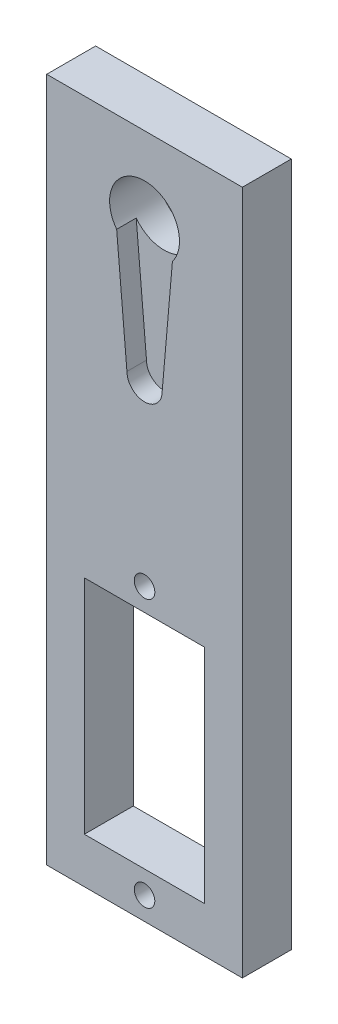
ISO-10303-21;
HEADER;
FILE_DESCRIPTION(('STEP AP214'),'2;1');
FILE_NAME('part.step','',(''),(''),'','','');
FILE_SCHEMA(('AUTOMOTIVE_DESIGN { 1 0 10303 214 1 1 1 1 }'));
ENDSEC;
DATA;
#1=APPLICATION_CONTEXT('core data for automotive mechanical design processes');
#2=APPLICATION_PROTOCOL_DEFINITION('international standard','automotive_design',2000,#1);
#3=PRODUCT_CONTEXT('',#1,'mechanical');
#4=PRODUCT('Part','Part','',(#3));
#5=PRODUCT_RELATED_PRODUCT_CATEGORY('part','',(#4));
#6=PRODUCT_DEFINITION_FORMATION('','',#4);
#7=PRODUCT_DEFINITION_CONTEXT('part definition',#1,'design');
#8=PRODUCT_DEFINITION('design','',#6,#7);
#9=PRODUCT_DEFINITION_SHAPE('','',#8);
#10=(LENGTH_UNIT() NAMED_UNIT(*) SI_UNIT(.MILLI.,.METRE.));
#11=(NAMED_UNIT(*) PLANE_ANGLE_UNIT() SI_UNIT($,.RADIAN.));
#12=(NAMED_UNIT(*) SI_UNIT($,.STERADIAN.) SOLID_ANGLE_UNIT());
#13=UNCERTAINTY_MEASURE_WITH_UNIT(LENGTH_MEASURE(1.E-05),#10,'distance_accuracy_value','');
#14=(GEOMETRIC_REPRESENTATION_CONTEXT(3) GLOBAL_UNCERTAINTY_ASSIGNED_CONTEXT((#13)) GLOBAL_UNIT_ASSIGNED_CONTEXT((#10,
#11,#12)) REPRESENTATION_CONTEXT('',''));
#15=CARTESIAN_POINT('',(0.,0.,0.));
#16=DIRECTION('',(0.,0.,1.));
#17=DIRECTION('',(1.,0.,0.));
#18=AXIS2_PLACEMENT_3D('',#15,#16,#17);
#19=CARTESIAN_POINT('',(9.99999999999999,35.,5.));
#20=DIRECTION('',(-1.,0.,0.));
#21=DIRECTION('',(0.,-1.,0.));
#22=AXIS2_PLACEMENT_3D('',#19,#20,#21);
#23=PLANE('',#22);
#24=DIRECTION('',(0.,1.,0.));
#25=VECTOR('',#24,1.);
#26=CARTESIAN_POINT('',(9.99999999999999,35.,0.));
#27=LINE('',#26,#25);
#28=CARTESIAN_POINT('',(10.,-35.,0.));
#29=VERTEX_POINT('',#28);
#30=CARTESIAN_POINT('',(9.99999999999999,35.,0.));
#31=VERTEX_POINT('',#30);
#32=EDGE_CURVE('E202',#29,#31,#27,.T.);
#33=ORIENTED_EDGE('',*,*,#32,.T.);
#34=DIRECTION('',(0.,0.,-1.));
#35=VECTOR('',#34,1.);
#36=CARTESIAN_POINT('',(9.99999999999999,35.,5.));
#37=LINE('',#36,#35);
#38=CARTESIAN_POINT('',(9.99999999999999,35.,5.));
#39=VERTEX_POINT('',#38);
#40=EDGE_CURVE('E12',#39,#31,#37,.T.);
#41=ORIENTED_EDGE('',*,*,#40,.F.);
#42=DIRECTION('',(0.,1.,0.));
#43=VECTOR('',#42,1.);
#44=CARTESIAN_POINT('',(9.99999999999999,35.,5.));
#45=LINE('',#44,#43);
#46=CARTESIAN_POINT('',(10.,-35.,5.));
#47=VERTEX_POINT('',#46);
#48=EDGE_CURVE('E211',#47,#39,#45,.T.);
#49=ORIENTED_EDGE('',*,*,#48,.F.);
#50=DIRECTION('',(0.,0.,-1.));
#51=VECTOR('',#50,1.);
#52=CARTESIAN_POINT('',(10.,-35.,5.));
#53=LINE('',#52,#51);
#54=EDGE_CURVE('E221',#47,#29,#53,.T.);
#55=ORIENTED_EDGE('',*,*,#54,.T.);
#56=EDGE_LOOP('',(#33,#41,#49,#55));
#57=FACE_BOUND('',#56,.T.);
#58=ADVANCED_FACE('F48',(#57),#23,.F.);
#59=CARTESIAN_POINT('',(-10.,35.,5.));
#60=DIRECTION('',(0.,-1.,0.));
#61=DIRECTION('',(0.,0.,-1.));
#62=AXIS2_PLACEMENT_3D('',#59,#60,#61);
#63=PLANE('',#62);
#64=DIRECTION('',(-1.,0.,0.));
#65=VECTOR('',#64,1.);
#66=CARTESIAN_POINT('',(-10.,35.,0.));
#67=LINE('',#66,#65);
#68=CARTESIAN_POINT('',(-10.,35.,0.));
#69=VERTEX_POINT('',#68);
#70=EDGE_CURVE('E224',#31,#69,#67,.T.);
#71=ORIENTED_EDGE('',*,*,#70,.T.);
#72=DIRECTION('',(0.,0.,-1.));
#73=VECTOR('',#72,1.);
#74=CARTESIAN_POINT('',(-10.,35.,5.));
#75=LINE('',#74,#73);
#76=CARTESIAN_POINT('',(-10.,35.,5.));
#77=VERTEX_POINT('',#76);
#78=EDGE_CURVE('E55',#77,#69,#75,.T.);
#79=ORIENTED_EDGE('',*,*,#78,.F.);
#80=DIRECTION('',(-1.,0.,0.));
#81=VECTOR('',#80,1.);
#82=CARTESIAN_POINT('',(-10.,35.,5.));
#83=LINE('',#82,#81);
#84=EDGE_CURVE('E214',#39,#77,#83,.T.);
#85=ORIENTED_EDGE('',*,*,#84,.F.);
#86=ORIENTED_EDGE('',*,*,#40,.T.);
#87=EDGE_LOOP('',(#71,#79,#85,#86));
#88=FACE_BOUND('',#87,.T.);
#89=ADVANCED_FACE('F253',(#88),#63,.F.);
#90=CARTESIAN_POINT('',(-10.,35.,5.));
#91=DIRECTION('',(1.,0.,0.));
#92=DIRECTION('',(0.,1.,0.));
#93=AXIS2_PLACEMENT_3D('',#90,#91,#92);
#94=PLANE('',#93);
#95=DIRECTION('',(0.,-1.,0.));
#96=VECTOR('',#95,1.);
#97=CARTESIAN_POINT('',(-10.,35.,0.));
#98=LINE('',#97,#96);
#99=CARTESIAN_POINT('',(-10.,-35.,0.));
#100=VERTEX_POINT('',#99);
#101=EDGE_CURVE('E226',#69,#100,#98,.T.);
#102=ORIENTED_EDGE('',*,*,#101,.T.);
#103=DIRECTION('',(0.,0.,-1.));
#104=VECTOR('',#103,1.);
#105=CARTESIAN_POINT('',(-10.,-35.,5.));
#106=LINE('',#105,#104);
#107=CARTESIAN_POINT('',(-10.,-35.,5.));
#108=VERTEX_POINT('',#107);
#109=EDGE_CURVE('E231',#108,#100,#106,.T.);
#110=ORIENTED_EDGE('',*,*,#109,.F.);
#111=DIRECTION('',(0.,-1.,0.));
#112=VECTOR('',#111,1.);
#113=CARTESIAN_POINT('',(-10.,35.,5.));
#114=LINE('',#113,#112);
#115=EDGE_CURVE('E217',#77,#108,#114,.T.);
#116=ORIENTED_EDGE('',*,*,#115,.F.);
#117=ORIENTED_EDGE('',*,*,#78,.T.);
#118=EDGE_LOOP('',(#102,#110,#116,#117));
#119=FACE_BOUND('',#118,.T.);
#120=ADVANCED_FACE('F238',(#119),#94,.F.);
#121=CARTESIAN_POINT('',(-10.,-35.,5.));
#122=DIRECTION('',(0.,1.,0.));
#123=DIRECTION('',(0.,0.,1.));
#124=AXIS2_PLACEMENT_3D('',#121,#122,#123);
#125=PLANE('',#124);
#126=DIRECTION('',(1.,0.,0.));
#127=VECTOR('',#126,1.);
#128=CARTESIAN_POINT('',(-10.,-35.,0.));
#129=LINE('',#128,#127);
#130=EDGE_CURVE('E215',#100,#29,#129,.T.);
#131=ORIENTED_EDGE('',*,*,#130,.T.);
#132=ORIENTED_EDGE('',*,*,#54,.F.);
#133=DIRECTION('',(1.,0.,0.));
#134=VECTOR('',#133,1.);
#135=CARTESIAN_POINT('',(-10.,-35.,5.));
#136=LINE('',#135,#134);
#137=EDGE_CURVE('E219',#108,#47,#136,.T.);
#138=ORIENTED_EDGE('',*,*,#137,.F.);
#139=ORIENTED_EDGE('',*,*,#109,.T.);
#140=EDGE_LOOP('',(#131,#132,#138,#139));
#141=FACE_BOUND('',#140,.T.);
#142=ADVANCED_FACE('F246',(#141),#125,.F.);
#143=CARTESIAN_POINT('',(0.,0.,5.));
#144=DIRECTION('',(0.,0.,1.));
#145=DIRECTION('',(1.,0.,0.));
#146=AXIS2_PLACEMENT_3D('',#143,#144,#145);
#147=PLANE('',#146);
#148=CARTESIAN_POINT('',(0.,-32.67,5.));
#149=DIRECTION('',(0.,0.,1.));
#150=DIRECTION('',(-1.,0.,0.));
#151=AXIS2_PLACEMENT_3D('',#148,#149,#150);
#152=CIRCLE('',#151,1.05);
#153=CARTESIAN_POINT('',(-1.05,-32.67,5.));
#154=VERTEX_POINT('',#153);
#155=EDGE_CURVE('E160',#154,#154,#152,.T.);
#156=ORIENTED_EDGE('',*,*,#155,.F.);
#157=EDGE_LOOP('',(#156));
#158=FACE_BOUND('',#157,.T.);
#159=CARTESIAN_POINT('',(0.,-5.32999999999999,5.));
#160=DIRECTION('',(0.,0.,1.));
#161=DIRECTION('',(1.,0.,0.));
#162=AXIS2_PLACEMENT_3D('',#159,#160,#161);
#163=CIRCLE('',#162,1.05);
#164=CARTESIAN_POINT('',(1.05,-5.32999999999999,5.));
#165=VERTEX_POINT('',#164);
#166=EDGE_CURVE('E314',#165,#165,#163,.T.);
#167=ORIENTED_EDGE('',*,*,#166,.F.);
#168=EDGE_LOOP('',(#167));
#169=FACE_BOUND('',#168,.T.);
#170=DIRECTION('',(0.,1.,0.));
#171=VECTOR('',#170,1.);
#172=CARTESIAN_POINT('',(6.15,-7.64999999999999,5.));
#173=LINE('',#172,#171);
#174=CARTESIAN_POINT('',(6.15,-30.35,5.));
#175=VERTEX_POINT('',#174);
#176=CARTESIAN_POINT('',(6.15,-7.64999999999999,5.));
#177=VERTEX_POINT('',#176);
#178=EDGE_CURVE('E62',#175,#177,#173,.T.);
#179=ORIENTED_EDGE('',*,*,#178,.F.);
#180=DIRECTION('',(1.,0.,0.));
#181=VECTOR('',#180,1.);
#182=CARTESIAN_POINT('',(-6.15,-30.35,5.));
#183=LINE('',#182,#181);
#184=CARTESIAN_POINT('',(-6.15,-30.35,5.));
#185=VERTEX_POINT('',#184);
#186=EDGE_CURVE('E154',#185,#175,#183,.T.);
#187=ORIENTED_EDGE('',*,*,#186,.F.);
#188=DIRECTION('',(0.,-1.,0.));
#189=VECTOR('',#188,1.);
#190=CARTESIAN_POINT('',(-6.15,-7.64999999999999,5.));
#191=LINE('',#190,#189);
#192=CARTESIAN_POINT('',(-6.15,-7.64999999999999,5.));
#193=VERTEX_POINT('',#192);
#194=EDGE_CURVE('E157',#193,#185,#191,.T.);
#195=ORIENTED_EDGE('',*,*,#194,.F.);
#196=DIRECTION('',(-1.,0.,0.));
#197=VECTOR('',#196,1.);
#198=CARTESIAN_POINT('',(-6.15,-7.64999999999999,5.));
#199=LINE('',#198,#197);
#200=EDGE_CURVE('E166',#177,#193,#199,.T.);
#201=ORIENTED_EDGE('',*,*,#200,.F.);
#202=EDGE_LOOP('',(#179,#187,#195,#201));
#203=FACE_BOUND('',#202,.T.);
#204=CARTESIAN_POINT('',(0.,12.7956671968215,5.));
#205=DIRECTION('',(0.,0.,1.));
#206=DIRECTION('',(1.,0.,0.));
#207=AXIS2_PLACEMENT_3D('',#204,#205,#206);
#208=CIRCLE('',#207,1.8);
#209=CARTESIAN_POINT('',(-1.8,12.7956671968215,5.));
#210=VERTEX_POINT('',#209);
#211=CARTESIAN_POINT('',(1.8,12.7956671968215,5.));
#212=VERTEX_POINT('',#211);
#213=EDGE_CURVE('E192',#210,#212,#208,.T.);
#214=ORIENTED_EDGE('',*,*,#213,.F.);
#215=DIRECTION('',(0.0867768595041323,-0.996227773480844,0.));
#216=VECTOR('',#215,1.);
#217=CARTESIAN_POINT('',(-0.680266342294317,-0.0592548997147578,5.));
#218=LINE('',#217,#216);
#219=CARTESIAN_POINT('',(-2.85,24.8500232559397,5.));
#220=VERTEX_POINT('',#219);
#221=EDGE_CURVE('E186',#220,#210,#218,.T.);
#222=ORIENTED_EDGE('',*,*,#221,.F.);
#223=CARTESIAN_POINT('',(0.,27.,5.));
#224=DIRECTION('',(0.,0.,1.));
#225=DIRECTION('',(1.,0.,0.));
#226=AXIS2_PLACEMENT_3D('',#223,#224,#225);
#227=CIRCLE('',#226,3.57);
#228=CARTESIAN_POINT('',(2.85,24.8500232559397,5.));
#229=VERTEX_POINT('',#228);
#230=EDGE_CURVE('E180',#229,#220,#227,.T.);
#231=ORIENTED_EDGE('',*,*,#230,.F.);
#232=DIRECTION('',(-0.0867768595041322,-0.996227773480844,0.));
#233=VECTOR('',#232,1.);
#234=CARTESIAN_POINT('',(0.680266342294319,-0.0592548997147579,5.));
#235=LINE('',#234,#233);
#236=EDGE_CURVE('E195',#229,#212,#235,.T.);
#237=ORIENTED_EDGE('',*,*,#236,.T.);
#238=EDGE_LOOP('',(#214,#222,#231,#237));
#239=FACE_BOUND('',#238,.T.);
#240=ORIENTED_EDGE('',*,*,#48,.T.);
#241=ORIENTED_EDGE('',*,*,#84,.T.);
#242=ORIENTED_EDGE('',*,*,#115,.T.);
#243=ORIENTED_EDGE('',*,*,#137,.T.);
#244=EDGE_LOOP('',(#240,#241,#242,#243));
#245=FACE_BOUND('',#244,.T.);
#246=ADVANCED_FACE('F252',(#158,#169,#203,#239,#245),#147,.T.);
#247=CARTESIAN_POINT('',(0.,0.,0.));
#248=DIRECTION('',(0.,0.,1.));
#249=DIRECTION('',(1.,0.,0.));
#250=AXIS2_PLACEMENT_3D('',#247,#248,#249);
#251=PLANE('',#250);
#252=CARTESIAN_POINT('',(0.,-32.67,0.));
#253=DIRECTION('',(0.,0.,1.));
#254=DIRECTION('',(-1.,0.,0.));
#255=AXIS2_PLACEMENT_3D('',#252,#253,#254);
#256=CIRCLE('',#255,1.05);
#257=CARTESIAN_POINT('',(-1.05,-32.67,0.));
#258=VERTEX_POINT('',#257);
#259=EDGE_CURVE('E316',#258,#258,#256,.T.);
#260=ORIENTED_EDGE('',*,*,#259,.T.);
#261=EDGE_LOOP('',(#260));
#262=FACE_BOUND('',#261,.T.);
#263=CARTESIAN_POINT('',(0.,-5.32999999999999,0.));
#264=DIRECTION('',(0.,0.,1.));
#265=DIRECTION('',(1.,0.,0.));
#266=AXIS2_PLACEMENT_3D('',#263,#264,#265);
#267=CIRCLE('',#266,1.05);
#268=CARTESIAN_POINT('',(1.05,-5.32999999999999,0.));
#269=VERTEX_POINT('',#268);
#270=EDGE_CURVE('E167',#269,#269,#267,.T.);
#271=ORIENTED_EDGE('',*,*,#270,.T.);
#272=EDGE_LOOP('',(#271));
#273=FACE_BOUND('',#272,.T.);
#274=DIRECTION('',(1.,0.,0.));
#275=VECTOR('',#274,1.);
#276=CARTESIAN_POINT('',(-6.15,-30.35,0.));
#277=LINE('',#276,#275);
#278=CARTESIAN_POINT('',(-6.15,-30.35,0.));
#279=VERTEX_POINT('',#278);
#280=CARTESIAN_POINT('',(6.15,-30.35,0.));
#281=VERTEX_POINT('',#280);
#282=EDGE_CURVE('E144',#279,#281,#277,.T.);
#283=ORIENTED_EDGE('',*,*,#282,.T.);
#284=DIRECTION('',(0.,1.,0.));
#285=VECTOR('',#284,1.);
#286=CARTESIAN_POINT('',(6.15,-7.64999999999999,0.));
#287=LINE('',#286,#285);
#288=CARTESIAN_POINT('',(6.15,-7.64999999999999,0.));
#289=VERTEX_POINT('',#288);
#290=EDGE_CURVE('E138',#281,#289,#287,.T.);
#291=ORIENTED_EDGE('',*,*,#290,.T.);
#292=DIRECTION('',(-1.,0.,0.));
#293=VECTOR('',#292,1.);
#294=CARTESIAN_POINT('',(-6.15,-7.64999999999999,0.));
#295=LINE('',#294,#293);
#296=CARTESIAN_POINT('',(-6.15,-7.64999999999999,0.));
#297=VERTEX_POINT('',#296);
#298=EDGE_CURVE('E147',#289,#297,#295,.T.);
#299=ORIENTED_EDGE('',*,*,#298,.T.);
#300=DIRECTION('',(0.,-1.,0.));
#301=VECTOR('',#300,1.);
#302=CARTESIAN_POINT('',(-6.15,-7.64999999999999,0.));
#303=LINE('',#302,#301);
#304=EDGE_CURVE('E70',#297,#279,#303,.T.);
#305=ORIENTED_EDGE('',*,*,#304,.T.);
#306=EDGE_LOOP('',(#283,#291,#299,#305));
#307=FACE_BOUND('',#306,.T.);
#308=CARTESIAN_POINT('',(0.,27.,0.));
#309=DIRECTION('',(0.,0.,1.));
#310=DIRECTION('',(1.,0.,0.));
#311=AXIS2_PLACEMENT_3D('',#308,#309,#310);
#312=CIRCLE('',#311,3.57);
#313=CARTESIAN_POINT('',(3.57,27.,0.));
#314=VERTEX_POINT('',#313);
#315=EDGE_CURVE('E177',#314,#314,#312,.T.);
#316=ORIENTED_EDGE('',*,*,#315,.T.);
#317=EDGE_LOOP('',(#316));
#318=FACE_BOUND('',#317,.T.);
#319=ORIENTED_EDGE('',*,*,#32,.F.);
#320=ORIENTED_EDGE('',*,*,#130,.F.);
#321=ORIENTED_EDGE('',*,*,#101,.F.);
#322=ORIENTED_EDGE('',*,*,#70,.F.);
#323=EDGE_LOOP('',(#319,#320,#321,#322));
#324=FACE_BOUND('',#323,.T.);
#325=ADVANCED_FACE('F151',(#262,#273,#307,#318,#324),#251,.F.);
#326=CARTESIAN_POINT('',(0.,12.7956671968215,3.));
#327=DIRECTION('',(0.,0.,1.));
#328=DIRECTION('',(1.,0.,0.));
#329=AXIS2_PLACEMENT_3D('',#326,#327,#328);
#330=CYLINDRICAL_SURFACE('',#329,1.8);
#331=ORIENTED_EDGE('',*,*,#213,.T.);
#332=DIRECTION('',(0.,0.,1.));
#333=VECTOR('',#332,1.);
#334=CARTESIAN_POINT('',(1.8,12.7956671968215,3.));
#335=LINE('',#334,#333);
#336=CARTESIAN_POINT('',(1.8,12.7956671968215,3.));
#337=VERTEX_POINT('',#336);
#338=EDGE_CURVE('E191',#337,#212,#335,.T.);
#339=ORIENTED_EDGE('',*,*,#338,.F.);
#340=CARTESIAN_POINT('',(0.,12.7956671968215,3.));
#341=DIRECTION('',(0.,0.,1.));
#342=DIRECTION('',(1.,0.,0.));
#343=AXIS2_PLACEMENT_3D('',#340,#341,#342);
#344=CIRCLE('',#343,1.8);
#345=CARTESIAN_POINT('',(-1.8,12.7956671968215,3.));
#346=VERTEX_POINT('',#345);
#347=EDGE_CURVE('E182',#346,#337,#344,.T.);
#348=ORIENTED_EDGE('',*,*,#347,.F.);
#349=DIRECTION('',(0.,0.,1.));
#350=VECTOR('',#349,1.);
#351=CARTESIAN_POINT('',(-1.8,12.7956671968215,3.));
#352=LINE('',#351,#350);
#353=EDGE_CURVE('E200',#346,#210,#352,.T.);
#354=ORIENTED_EDGE('',*,*,#353,.T.);
#355=EDGE_LOOP('',(#331,#339,#348,#354));
#356=FACE_BOUND('',#355,.T.);
#357=ADVANCED_FACE('F265',(#356),#330,.F.);
#358=CARTESIAN_POINT('',(-0.680266342294317,-0.0592548997147578,3.));
#359=DIRECTION('',(-0.996227773480844,-0.0867768595041323,0.));
#360=DIRECTION('',(0.0867768595041323,-0.996227773480844,0.));
#361=AXIS2_PLACEMENT_3D('',#358,#359,#360);
#362=PLANE('',#361);
#363=ORIENTED_EDGE('',*,*,#221,.T.);
#364=ORIENTED_EDGE('',*,*,#353,.F.);
#365=DIRECTION('',(0.0867768595041323,-0.996227773480844,0.));
#366=VECTOR('',#365,1.);
#367=CARTESIAN_POINT('',(-0.680266342294317,-0.0592548997147578,3.));
#368=LINE('',#367,#366);
#369=CARTESIAN_POINT('',(-2.85,24.8500232559397,3.));
#370=VERTEX_POINT('',#369);
#371=EDGE_CURVE('E188',#370,#346,#368,.T.);
#372=ORIENTED_EDGE('',*,*,#371,.F.);
#373=DIRECTION('',(0.,0.,1.));
#374=VECTOR('',#373,1.);
#375=CARTESIAN_POINT('',(-2.85,24.8500232559397,3.));
#376=LINE('',#375,#374);
#377=EDGE_CURVE('E203',#370,#220,#376,.T.);
#378=ORIENTED_EDGE('',*,*,#377,.T.);
#379=EDGE_LOOP('',(#363,#364,#372,#378));
#380=FACE_BOUND('',#379,.T.);
#381=ADVANCED_FACE('F277',(#380),#362,.F.);
#382=CARTESIAN_POINT('',(0.680266342294319,-0.0592548997147579,3.));
#383=DIRECTION('',(-0.996227773480844,0.0867768595041322,0.));
#384=DIRECTION('',(-0.0867768595041322,-0.996227773480844,0.));
#385=AXIS2_PLACEMENT_3D('',#382,#383,#384);
#386=PLANE('',#385);
#387=ORIENTED_EDGE('',*,*,#236,.F.);
#388=DIRECTION('',(0.,0.,1.));
#389=VECTOR('',#388,1.);
#390=CARTESIAN_POINT('',(2.85,24.8500232559397,3.));
#391=LINE('',#390,#389);
#392=CARTESIAN_POINT('',(2.85,24.8500232559397,3.));
#393=VERTEX_POINT('',#392);
#394=EDGE_CURVE('E205',#393,#229,#391,.T.);
#395=ORIENTED_EDGE('',*,*,#394,.F.);
#396=DIRECTION('',(-0.0867768595041322,-0.996227773480844,0.));
#397=VECTOR('',#396,1.);
#398=CARTESIAN_POINT('',(0.680266342294319,-0.0592548997147579,3.));
#399=LINE('',#398,#397);
#400=EDGE_CURVE('E185',#393,#337,#399,.T.);
#401=ORIENTED_EDGE('',*,*,#400,.T.);
#402=ORIENTED_EDGE('',*,*,#338,.T.);
#403=EDGE_LOOP('',(#387,#395,#401,#402));
#404=FACE_BOUND('',#403,.T.);
#405=ADVANCED_FACE('F279',(#404),#386,.T.);
#406=CARTESIAN_POINT('',(0.,0.,3.));
#407=DIRECTION('',(0.,0.,1.));
#408=DIRECTION('',(1.,0.,0.));
#409=AXIS2_PLACEMENT_3D('',#406,#407,#408);
#410=PLANE('',#409);
#411=CARTESIAN_POINT('',(0.,27.,3.));
#412=DIRECTION('',(0.,0.,1.));
#413=DIRECTION('',(1.,0.,0.));
#414=AXIS2_PLACEMENT_3D('',#411,#412,#413);
#415=CIRCLE('',#414,3.57);
#416=EDGE_CURVE('E173',#370,#393,#415,.T.);
#417=ORIENTED_EDGE('',*,*,#416,.F.);
#418=ORIENTED_EDGE('',*,*,#371,.T.);
#419=ORIENTED_EDGE('',*,*,#347,.T.);
#420=ORIENTED_EDGE('',*,*,#400,.F.);
#421=EDGE_LOOP('',(#417,#418,#419,#420));
#422=FACE_BOUND('',#421,.T.);
#423=ADVANCED_FACE('F273',(#422),#410,.T.);
#424=CARTESIAN_POINT('',(0.,27.,3.));
#425=DIRECTION('',(0.,0.,1.));
#426=DIRECTION('',(1.,0.,0.));
#427=AXIS2_PLACEMENT_3D('',#424,#425,#426);
#428=CYLINDRICAL_SURFACE('',#427,3.57);
#429=ORIENTED_EDGE('',*,*,#377,.F.);
#430=ORIENTED_EDGE('',*,*,#416,.T.);
#431=ORIENTED_EDGE('',*,*,#394,.T.);
#432=ORIENTED_EDGE('',*,*,#230,.T.);
#433=EDGE_LOOP('',(#429,#430,#431,#432));
#434=FACE_BOUND('',#433,.T.);
#435=ORIENTED_EDGE('',*,*,#315,.F.);
#436=EDGE_LOOP('',(#435));
#437=FACE_BOUND('',#436,.T.);
#438=ADVANCED_FACE('F267',(#434,#437),#428,.F.);
#439=CARTESIAN_POINT('',(6.15,-7.64999999999999,0.));
#440=DIRECTION('',(1.,0.,0.));
#441=DIRECTION('',(0.,1.,0.));
#442=AXIS2_PLACEMENT_3D('',#439,#440,#441);
#443=PLANE('',#442);
#444=ORIENTED_EDGE('',*,*,#178,.T.);
#445=DIRECTION('',(0.,0.,1.));
#446=VECTOR('',#445,1.);
#447=CARTESIAN_POINT('',(6.15,-7.64999999999999,0.));
#448=LINE('',#447,#446);
#449=EDGE_CURVE('E134',#289,#177,#448,.T.);
#450=ORIENTED_EDGE('',*,*,#449,.F.);
#451=ORIENTED_EDGE('',*,*,#290,.F.);
#452=DIRECTION('',(0.,0.,1.));
#453=VECTOR('',#452,1.);
#454=CARTESIAN_POINT('',(6.15,-30.35,0.));
#455=LINE('',#454,#453);
#456=EDGE_CURVE('E171',#281,#175,#455,.T.);
#457=ORIENTED_EDGE('',*,*,#456,.T.);
#458=EDGE_LOOP('',(#444,#450,#451,#457));
#459=FACE_BOUND('',#458,.T.);
#460=ADVANCED_FACE('F136',(#459),#443,.F.);
#461=CARTESIAN_POINT('',(-6.15,-30.35,0.));
#462=DIRECTION('',(0.,-1.,0.));
#463=DIRECTION('',(1.,0.,0.));
#464=AXIS2_PLACEMENT_3D('',#461,#462,#463);
#465=PLANE('',#464);
#466=ORIENTED_EDGE('',*,*,#186,.T.);
#467=ORIENTED_EDGE('',*,*,#456,.F.);
#468=ORIENTED_EDGE('',*,*,#282,.F.);
#469=DIRECTION('',(0.,0.,1.));
#470=VECTOR('',#469,1.);
#471=CARTESIAN_POINT('',(-6.15,-30.35,0.));
#472=LINE('',#471,#470);
#473=EDGE_CURVE('E174',#279,#185,#472,.T.);
#474=ORIENTED_EDGE('',*,*,#473,.T.);
#475=EDGE_LOOP('',(#466,#467,#468,#474));
#476=FACE_BOUND('',#475,.T.);
#477=ADVANCED_FACE('F291',(#476),#465,.F.);
#478=CARTESIAN_POINT('',(-6.15,-7.64999999999999,0.));
#479=DIRECTION('',(-1.,0.,0.));
#480=DIRECTION('',(0.,-1.,0.));
#481=AXIS2_PLACEMENT_3D('',#478,#479,#480);
#482=PLANE('',#481);
#483=ORIENTED_EDGE('',*,*,#194,.T.);
#484=ORIENTED_EDGE('',*,*,#473,.F.);
#485=ORIENTED_EDGE('',*,*,#304,.F.);
#486=DIRECTION('',(0.,0.,1.));
#487=VECTOR('',#486,1.);
#488=CARTESIAN_POINT('',(-6.15,-7.64999999999999,0.));
#489=LINE('',#488,#487);
#490=EDGE_CURVE('E143',#297,#193,#489,.T.);
#491=ORIENTED_EDGE('',*,*,#490,.T.);
#492=EDGE_LOOP('',(#483,#484,#485,#491));
#493=FACE_BOUND('',#492,.T.);
#494=ADVANCED_FACE('F295',(#493),#482,.F.);
#495=CARTESIAN_POINT('',(-6.15,-7.64999999999999,0.));
#496=DIRECTION('',(0.,1.,0.));
#497=DIRECTION('',(-1.,0.,0.));
#498=AXIS2_PLACEMENT_3D('',#495,#496,#497);
#499=PLANE('',#498);
#500=ORIENTED_EDGE('',*,*,#200,.T.);
#501=ORIENTED_EDGE('',*,*,#490,.F.);
#502=ORIENTED_EDGE('',*,*,#298,.F.);
#503=ORIENTED_EDGE('',*,*,#449,.T.);
#504=EDGE_LOOP('',(#500,#501,#502,#503));
#505=FACE_BOUND('',#504,.T.);
#506=ADVANCED_FACE('F148',(#505),#499,.F.);
#507=CARTESIAN_POINT('',(0.,-5.32999999999999,0.));
#508=DIRECTION('',(0.,0.,1.));
#509=DIRECTION('',(1.,0.,0.));
#510=AXIS2_PLACEMENT_3D('',#507,#508,#509);
#511=CYLINDRICAL_SURFACE('',#510,1.05);
#512=ORIENTED_EDGE('',*,*,#270,.F.);
#513=EDGE_LOOP('',(#512));
#514=FACE_BOUND('',#513,.T.);
#515=ORIENTED_EDGE('',*,*,#166,.T.);
#516=EDGE_LOOP('',(#515));
#517=FACE_BOUND('',#516,.T.);
#518=ADVANCED_FACE('F294',(#514,#517),#511,.F.);
#519=CARTESIAN_POINT('',(0.,-32.67,0.));
#520=DIRECTION('',(0.,0.,1.));
#521=DIRECTION('',(1.,0.,0.));
#522=AXIS2_PLACEMENT_3D('',#519,#520,#521);
#523=CYLINDRICAL_SURFACE('',#522,1.05);
#524=ORIENTED_EDGE('',*,*,#259,.F.);
#525=EDGE_LOOP('',(#524));
#526=FACE_BOUND('',#525,.T.);
#527=ORIENTED_EDGE('',*,*,#155,.T.);
#528=EDGE_LOOP('',(#527));
#529=FACE_BOUND('',#528,.T.);
#530=ADVANCED_FACE('F301',(#526,#529),#523,.F.);
#531=CLOSED_SHELL('',(#58,#89,#120,#142,#246,#325,#357,#381,#405,#423,#438,#460,#477,#494,#506,
#518,#530));
#532=MANIFOLD_SOLID_BREP('B2',#531);
#533=ADVANCED_BREP_SHAPE_REPRESENTATION('',(#18,#532),#14);
#534=SHAPE_DEFINITION_REPRESENTATION(#9,#533);
ENDSEC;
END-ISO-10303-21;
